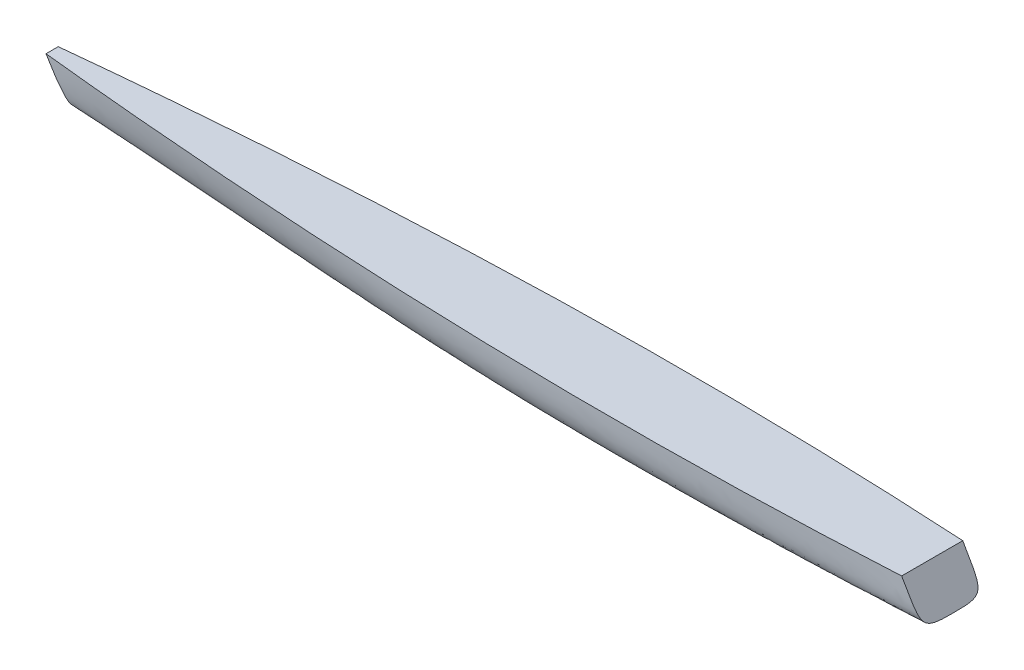
ISO-10303-21;
HEADER;
FILE_DESCRIPTION(('STEP AP214'),'2;1');
FILE_NAME('part.step','',(''),(''),'','','');
FILE_SCHEMA(('AUTOMOTIVE_DESIGN { 1 0 10303 214 1 1 1 1 }'));
ENDSEC;
DATA;
#1=APPLICATION_CONTEXT('core data for automotive mechanical design processes');
#2=APPLICATION_PROTOCOL_DEFINITION('international standard','automotive_design',2000,#1);
#3=PRODUCT_CONTEXT('',#1,'mechanical');
#4=PRODUCT('Part','Part','',(#3));
#5=PRODUCT_RELATED_PRODUCT_CATEGORY('part','',(#4));
#6=PRODUCT_DEFINITION_FORMATION('','',#4);
#7=PRODUCT_DEFINITION_CONTEXT('part definition',#1,'design');
#8=PRODUCT_DEFINITION('design','',#6,#7);
#9=PRODUCT_DEFINITION_SHAPE('','',#8);
#10=(LENGTH_UNIT() NAMED_UNIT(*) SI_UNIT(.MILLI.,.METRE.));
#11=(NAMED_UNIT(*) PLANE_ANGLE_UNIT() SI_UNIT($,.RADIAN.));
#12=(NAMED_UNIT(*) SI_UNIT($,.STERADIAN.) SOLID_ANGLE_UNIT());
#13=UNCERTAINTY_MEASURE_WITH_UNIT(LENGTH_MEASURE(1.E-05),#10,'distance_accuracy_value','');
#14=(GEOMETRIC_REPRESENTATION_CONTEXT(3) GLOBAL_UNCERTAINTY_ASSIGNED_CONTEXT((#13)) GLOBAL_UNIT_ASSIGNED_CONTEXT((#10,
#11,#12)) REPRESENTATION_CONTEXT('',''));
#15=CARTESIAN_POINT('',(0.,0.,0.));
#16=DIRECTION('',(0.,0.,1.));
#17=DIRECTION('',(1.,0.,0.));
#18=AXIS2_PLACEMENT_3D('',#15,#16,#17);
#19=CARTESIAN_POINT('',(435.202954743875,38.1,-31.75));
#20=CARTESIAN_POINT('',(289.96470358542,38.1,-40.0082514445591));
#21=CARTESIAN_POINT('',(-3.47870363388707,38.1,-44.1608103430224));
#22=CARTESIAN_POINT('',(-319.63529641458,38.1,-23.0749181112258));
#23=CARTESIAN_POINT('',(-479.197045256125,38.1,-6.35));
#24=CARTESIAN_POINT('',(456.369621410542,1.43825790645888,-31.75));
#25=CARTESIAN_POINT('',(308.744120638238,-1.38396431576335,-37.2555009630394));
#26=CARTESIAN_POINT('',(-18.3058318151969,19.9050399712793,-48.2472921755886));
#27=CARTESIAN_POINT('',(-309.322546028428,13.2807325216531,-17.4999454074839));
#28=CARTESIAN_POINT('',(-466.497045256125,16.1029547438753,-6.35));
#29=CARTESIAN_POINT('',(457.2,0.,-33.8666666666667));
#30=CARTESIAN_POINT('',(307.187249613848,-5.64444444444444,-36.6194171481864));
#31=CARTESIAN_POINT('',(-20.7324014512263,-19.7683175000991,-43.732083273171));
#32=CARTESIAN_POINT('',(-302.412750386152,-5.64444444444449,-9.80830603707527));
#33=CARTESIAN_POINT('',(-457.2,0.,-4.23333333333334));
#34=CARTESIAN_POINT('',(457.2,0.,0.));
#35=CARTESIAN_POINT('',(304.8,-8.46666666666666,0.));
#36=CARTESIAN_POINT('',(-18.3408338291158,-16.9409905000595,0.));
#37=CARTESIAN_POINT('',(-304.8,-8.46666666666668,0.));
#38=CARTESIAN_POINT('',(-457.2,0.,0.));
#39=B_SPLINE_SURFACE_WITH_KNOTS('',3,3,((#19,#20,#21,#22,#23),(#24,#25,#26,#27,#28),(#29,#30,
#31,#32,#33),(#34,#35,#36,#37,#38)),.UNSPECIFIED.,.F.,.F.,.F.,(4,4),(4,1,4),(0.,1.),(0.,
0.48497025791141,1.),.UNSPECIFIED.);
#40=CARTESIAN_POINT('',(435.202954743875,38.1,-31.75));
#41=CARTESIAN_POINT('',(456.369621410542,1.43825790645888,-31.75));
#42=CARTESIAN_POINT('',(457.2,0.,-33.8666666666667));
#43=CARTESIAN_POINT('',(457.2,0.,0.));
#44=B_SPLINE_CURVE_WITH_KNOTS('',3,(#40,#41,#42,#43),.UNSPECIFIED.,.F.,.F.,(4,4),(0.,1.),.UNSPECIFIED.);
#45=CARTESIAN_POINT('',(457.2,0.,0.));
#46=VERTEX_POINT('',#45);
#47=CARTESIAN_POINT('',(435.202954743875,38.1,-31.75));
#48=VERTEX_POINT('',#47);
#49=EDGE_CURVE('E98',#46,#48,#44,.F.);
#50=CARTESIAN_POINT('',(457.2,0.,0.));
#51=CARTESIAN_POINT('',(304.8,-8.46666666666666,0.));
#52=CARTESIAN_POINT('',(-18.3408338291158,-16.9409905000595,0.));
#53=CARTESIAN_POINT('',(-304.8,-8.46666666666668,0.));
#54=CARTESIAN_POINT('',(-457.2,0.,0.));
#55=B_SPLINE_CURVE_WITH_KNOTS('',3,(#50,#51,#52,#53,#54),.UNSPECIFIED.,.F.,.F.,(4,1,4),(0.,
0.48497025791141,1.),.UNSPECIFIED.);
#56=CARTESIAN_POINT('',(-457.2,0.,0.));
#57=VERTEX_POINT('',#56);
#58=EDGE_CURVE('E90',#57,#46,#55,.F.);
#59=CARTESIAN_POINT('',(-479.197045256125,38.1,-6.35));
#60=CARTESIAN_POINT('',(-466.497045256125,16.1029547438753,-6.35));
#61=CARTESIAN_POINT('',(-457.2,0.,-4.23333333333334));
#62=CARTESIAN_POINT('',(-457.2,0.,0.));
#63=B_SPLINE_CURVE_WITH_KNOTS('',3,(#59,#60,#61,#62),.UNSPECIFIED.,.F.,.F.,(4,4),(0.,1.),.UNSPECIFIED.);
#64=CARTESIAN_POINT('',(-479.197045256125,38.1,-6.35));
#65=VERTEX_POINT('',#64);
#66=EDGE_CURVE('E54',#65,#57,#63,.T.);
#67=CARTESIAN_POINT('',(435.202954743875,38.1,-31.75));
#68=CARTESIAN_POINT('',(289.96470358542,38.1,-40.0082514445591));
#69=CARTESIAN_POINT('',(-3.47870363388707,38.1,-44.1608103430224));
#70=CARTESIAN_POINT('',(-319.63529641458,38.1,-23.0749181112258));
#71=CARTESIAN_POINT('',(-479.197045256125,38.1,-6.35));
#72=B_SPLINE_CURVE_WITH_KNOTS('',3,(#67,#68,#69,#70,#71),.UNSPECIFIED.,.F.,.F.,(4,1,4),(0.,
0.48497025791141,1.),.UNSPECIFIED.);
#73=EDGE_CURVE('E61',#65,#48,#72,.F.);
#74=ORIENTED_EDGE('',*,*,#49,.F.);
#75=ORIENTED_EDGE('',*,*,#58,.F.);
#76=ORIENTED_EDGE('',*,*,#66,.F.);
#77=ORIENTED_EDGE('',*,*,#73,.T.);
#78=EDGE_LOOP('',(#74,#75,#76,#77));
#79=FACE_BOUND('',#78,.T.);
#80=ADVANCED_FACE('F49',(#79),#39,.T.);
#81=CARTESIAN_POINT('',(-342.899999999998,-197.973407305124,0.));
#82=DIRECTION('',(-0.866025403784436,-0.500000000000004,0.));
#83=DIRECTION('',(0.500000000000004,-0.866025403784436,0.));
#84=AXIS2_PLACEMENT_3D('',#81,#82,#83);
#85=PLANE('',#84);
#86=DIRECTION('',(0.,0.,-1.));
#87=VECTOR('',#86,1.);
#88=CARTESIAN_POINT('',(-479.197045256125,38.1,0.));
#89=LINE('',#88,#87);
#90=CARTESIAN_POINT('',(-479.197045256125,38.1,6.35));
#91=VERTEX_POINT('',#90);
#92=EDGE_CURVE('E102',#91,#65,#89,.T.);
#93=ORIENTED_EDGE('',*,*,#92,.T.);
#94=ORIENTED_EDGE('',*,*,#66,.T.);
#95=CARTESIAN_POINT('',(-479.197045256125,38.1,6.35));
#96=CARTESIAN_POINT('',(-466.497045256125,16.1029547438753,6.35));
#97=CARTESIAN_POINT('',(-457.2,0.,4.23333333333334));
#98=CARTESIAN_POINT('',(-457.2,0.,0.));
#99=B_SPLINE_CURVE_WITH_KNOTS('',3,(#95,#96,#97,#98),.UNSPECIFIED.,.F.,.F.,(4,4),(0.,1.),.UNSPECIFIED.);
#100=EDGE_CURVE('E87',#91,#57,#99,.T.);
#101=ORIENTED_EDGE('',*,*,#100,.F.);
#102=EDGE_LOOP('',(#93,#94,#101));
#103=FACE_BOUND('',#102,.T.);
#104=ADVANCED_FACE('F101',(#103),#85,.T.);
#105=CARTESIAN_POINT('',(342.899999999998,197.973407305124,0.));
#106=DIRECTION('',(0.866025403784436,0.500000000000004,0.));
#107=DIRECTION('',(-0.500000000000004,0.866025403784436,0.));
#108=AXIS2_PLACEMENT_3D('',#105,#106,#107);
#109=PLANE('',#108);
#110=ORIENTED_EDGE('',*,*,#49,.T.);
#111=DIRECTION('',(0.,0.,1.));
#112=VECTOR('',#111,1.);
#113=CARTESIAN_POINT('',(435.202954743875,38.1,0.));
#114=LINE('',#113,#112);
#115=CARTESIAN_POINT('',(435.202954743875,38.1,31.75));
#116=VERTEX_POINT('',#115);
#117=EDGE_CURVE('E12',#48,#116,#114,.T.);
#118=ORIENTED_EDGE('',*,*,#117,.T.);
#119=CARTESIAN_POINT('',(435.202954743875,38.1,31.75));
#120=CARTESIAN_POINT('',(456.369621410542,1.43825790645888,31.75));
#121=CARTESIAN_POINT('',(457.2,0.,33.8666666666667));
#122=CARTESIAN_POINT('',(457.2,0.,0.));
#123=B_SPLINE_CURVE_WITH_KNOTS('',3,(#119,#120,#121,#122),.UNSPECIFIED.,.F.,.F.,(4,4),(0.,1.),.UNSPECIFIED.);
#124=EDGE_CURVE('E96',#46,#116,#123,.F.);
#125=ORIENTED_EDGE('',*,*,#124,.F.);
#126=EDGE_LOOP('',(#110,#118,#125));
#127=FACE_BOUND('',#126,.T.);
#128=ADVANCED_FACE('F157',(#127),#109,.T.);
#129=CARTESIAN_POINT('',(0.,38.1,0.));
#130=DIRECTION('',(0.,-1.,0.));
#131=DIRECTION('',(0.,0.,-1.));
#132=AXIS2_PLACEMENT_3D('',#129,#130,#131);
#133=PLANE('',#132);
#134=ORIENTED_EDGE('',*,*,#92,.F.);
#135=CARTESIAN_POINT('',(435.202954743875,38.1,31.75));
#136=CARTESIAN_POINT('',(289.96470358542,38.1,40.0082514445591));
#137=CARTESIAN_POINT('',(-3.47870363388707,38.1,44.1608103430224));
#138=CARTESIAN_POINT('',(-319.63529641458,38.1,23.0749181112258));
#139=CARTESIAN_POINT('',(-479.197045256125,38.1,6.35));
#140=B_SPLINE_CURVE_WITH_KNOTS('',3,(#135,#136,#137,#138,#139),.UNSPECIFIED.,.F.,.F.,(4,1,4),
(0.,0.48497025791141,1.),.UNSPECIFIED.);
#141=EDGE_CURVE('E93',#91,#116,#140,.F.);
#142=ORIENTED_EDGE('',*,*,#141,.T.);
#143=ORIENTED_EDGE('',*,*,#117,.F.);
#144=ORIENTED_EDGE('',*,*,#73,.F.);
#145=EDGE_LOOP('',(#134,#142,#143,#144));
#146=FACE_BOUND('',#145,.T.);
#147=ADVANCED_FACE('F156',(#146),#133,.F.);
#148=CARTESIAN_POINT('',(435.202954743875,38.1,31.75));
#149=CARTESIAN_POINT('',(289.96470358542,38.1,40.0082514445591));
#150=CARTESIAN_POINT('',(-3.47870363388707,38.1,44.1608103430224));
#151=CARTESIAN_POINT('',(-319.63529641458,38.1,23.0749181112258));
#152=CARTESIAN_POINT('',(-479.197045256125,38.1,6.35));
#153=CARTESIAN_POINT('',(456.369621410542,1.43825790645888,31.75));
#154=CARTESIAN_POINT('',(308.744120638238,-1.38396431576335,37.2555009630394));
#155=CARTESIAN_POINT('',(-18.3058318151969,19.9050399712793,48.2472921755886));
#156=CARTESIAN_POINT('',(-309.322546028428,13.2807325216531,17.4999454074839));
#157=CARTESIAN_POINT('',(-466.497045256125,16.1029547438753,6.35));
#158=CARTESIAN_POINT('',(457.2,0.,33.8666666666667));
#159=CARTESIAN_POINT('',(307.187249613848,-5.64444444444444,36.6194171481864));
#160=CARTESIAN_POINT('',(-20.7324014512263,-19.7683175000991,43.732083273171));
#161=CARTESIAN_POINT('',(-302.412750386152,-5.64444444444449,9.80830603707527));
#162=CARTESIAN_POINT('',(-457.2,0.,4.23333333333334));
#163=CARTESIAN_POINT('',(457.2,0.,0.));
#164=CARTESIAN_POINT('',(304.8,-8.46666666666666,0.));
#165=CARTESIAN_POINT('',(-18.3408338291158,-16.9409905000595,0.));
#166=CARTESIAN_POINT('',(-304.8,-8.46666666666668,0.));
#167=CARTESIAN_POINT('',(-457.2,0.,0.));
#168=B_SPLINE_SURFACE_WITH_KNOTS('',3,3,((#148,#149,#150,#151,#152),(#153,#154,#155,#156,#157),
(#158,#159,#160,#161,#162),(#163,#164,#165,#166,#167)),.UNSPECIFIED.,.F.,.F.,.F.,(4,4),(4,1,4),
(0.,1.),(0.,0.48497025791141,1.),.UNSPECIFIED.);
#169=ORIENTED_EDGE('',*,*,#124,.T.);
#170=ORIENTED_EDGE('',*,*,#141,.F.);
#171=ORIENTED_EDGE('',*,*,#100,.T.);
#172=ORIENTED_EDGE('',*,*,#58,.T.);
#173=EDGE_LOOP('',(#169,#170,#171,#172));
#174=FACE_BOUND('',#173,.T.);
#175=ADVANCED_FACE('F89',(#174),#168,.F.);
#176=CLOSED_SHELL('',(#80,#104,#128,#147,#175));
#177=MANIFOLD_SOLID_BREP('B2',#176);
#178=ADVANCED_BREP_SHAPE_REPRESENTATION('',(#18,#177),#14);
#179=SHAPE_DEFINITION_REPRESENTATION(#9,#178);
ENDSEC;
END-ISO-10303-21;
